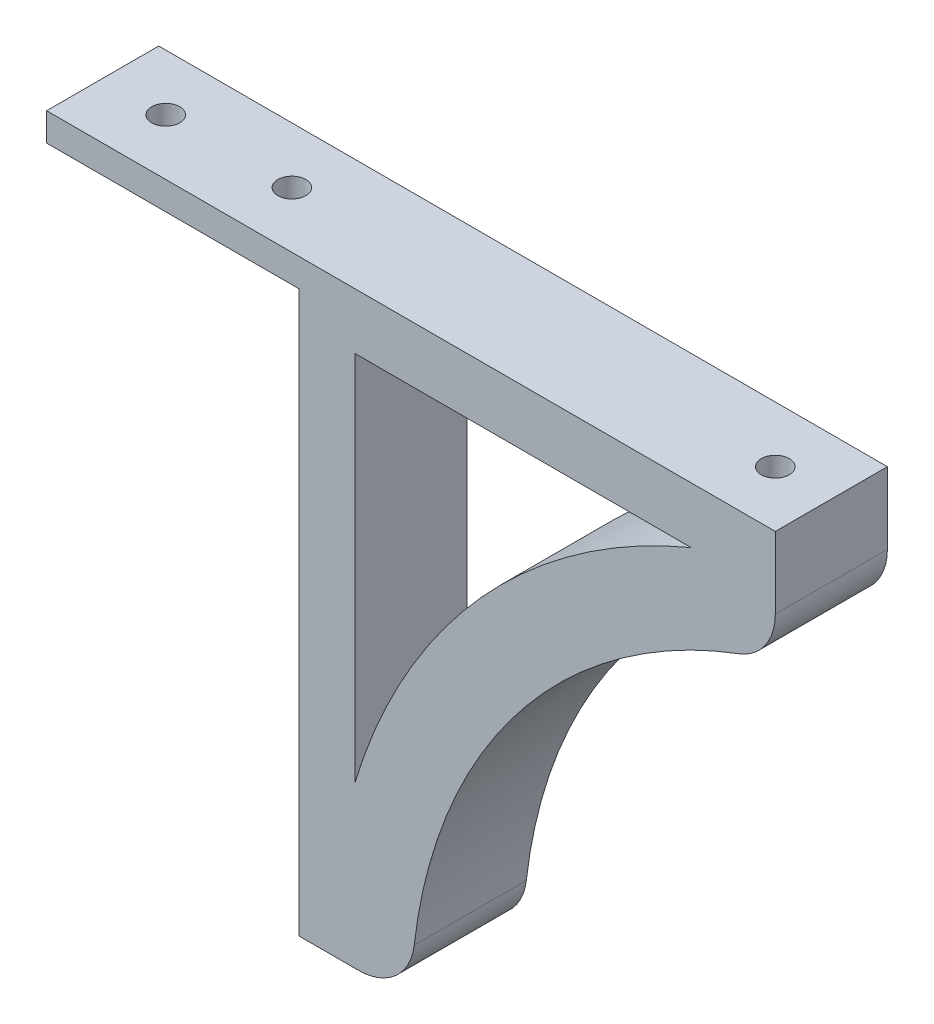
ISO-10303-21;
HEADER;
FILE_DESCRIPTION(('STEP AP214'),'2;1');
FILE_NAME('part.step','',(''),(''),'','','');
FILE_SCHEMA(('AUTOMOTIVE_DESIGN { 1 0 10303 214 1 1 1 1 }'));
ENDSEC;
DATA;
#1=APPLICATION_CONTEXT('core data for automotive mechanical design processes');
#2=APPLICATION_PROTOCOL_DEFINITION('international standard','automotive_design',2000,#1);
#3=PRODUCT_CONTEXT('',#1,'mechanical');
#4=PRODUCT('Part','Part','',(#3));
#5=PRODUCT_RELATED_PRODUCT_CATEGORY('part','',(#4));
#6=PRODUCT_DEFINITION_FORMATION('','',#4);
#7=PRODUCT_DEFINITION_CONTEXT('part definition',#1,'design');
#8=PRODUCT_DEFINITION('design','',#6,#7);
#9=PRODUCT_DEFINITION_SHAPE('','',#8);
#10=(LENGTH_UNIT() NAMED_UNIT(*) SI_UNIT(.MILLI.,.METRE.));
#11=(NAMED_UNIT(*) PLANE_ANGLE_UNIT() SI_UNIT($,.RADIAN.));
#12=(NAMED_UNIT(*) SI_UNIT($,.STERADIAN.) SOLID_ANGLE_UNIT());
#13=UNCERTAINTY_MEASURE_WITH_UNIT(LENGTH_MEASURE(1.E-05),#10,'distance_accuracy_value','');
#14=(GEOMETRIC_REPRESENTATION_CONTEXT(3) GLOBAL_UNCERTAINTY_ASSIGNED_CONTEXT((#13)) GLOBAL_UNIT_ASSIGNED_CONTEXT((#10,
#11,#12)) REPRESENTATION_CONTEXT('',''));
#15=CARTESIAN_POINT('',(0.,0.,0.));
#16=DIRECTION('',(0.,0.,1.));
#17=DIRECTION('',(1.,0.,0.));
#18=AXIS2_PLACEMENT_3D('',#15,#16,#17);
#19=CARTESIAN_POINT('',(154.988132437739,-101.461513040624,20.));
#20=DIRECTION('',(0.,0.,1.));
#21=DIRECTION('',(1.,0.,0.));
#22=AXIS2_PLACEMENT_3D('',#19,#20,#21);
#23=PLANE('',#22);
#24=DIRECTION('',(1.,0.,0.));
#25=VECTOR('',#24,1.);
#26=CARTESIAN_POINT('',(45.,-100.,20.));
#27=LINE('',#26,#25);
#28=CARTESIAN_POINT('',(45.,-100.,20.));
#29=VERTEX_POINT('',#28);
#30=CARTESIAN_POINT('',(55.6471352672879,-100.,20.));
#31=VERTEX_POINT('',#30);
#32=EDGE_CURVE('E280',#29,#31,#27,.T.);
#33=ORIENTED_EDGE('',*,*,#32,.T.);
#34=CARTESIAN_POINT('',(55.6471352672879,-90.,20.));
#35=DIRECTION('',(0.,0.,1.));
#36=DIRECTION('',(1.,0.,0.));
#37=AXIS2_PLACEMENT_3D('',#34,#35,#36);
#38=CIRCLE('',#37,10.);
#39=CARTESIAN_POINT('',(65.5812349843331,-91.1461513040624,20.));
#40=VERTEX_POINT('',#39);
#41=EDGE_CURVE('E45',#31,#40,#38,.T.);
#42=ORIENTED_EDGE('',*,*,#41,.T.);
#43=CARTESIAN_POINT('',(154.988132437739,-101.461513040624,20.));
#44=DIRECTION('',(0.,0.,-1.));
#45=DIRECTION('',(1.,0.,0.));
#46=AXIS2_PLACEMENT_3D('',#43,#44,#45);
#47=CIRCLE('',#46,90.);
#48=CARTESIAN_POINT('',(123.498813243774,-17.1500501384744,20.));
#49=VERTEX_POINT('',#48);
#50=EDGE_CURVE('E245',#40,#49,#47,.T.);
#51=ORIENTED_EDGE('',*,*,#50,.T.);
#52=CARTESIAN_POINT('',(120.,-7.78210981601328,20.));
#53=DIRECTION('',(0.,0.,1.));
#54=DIRECTION('',(1.,0.,0.));
#55=AXIS2_PLACEMENT_3D('',#52,#53,#54);
#56=CIRCLE('',#55,10.);
#57=CARTESIAN_POINT('',(130.,-7.78210981601328,20.));
#58=VERTEX_POINT('',#57);
#59=EDGE_CURVE('E147',#49,#58,#56,.T.);
#60=ORIENTED_EDGE('',*,*,#59,.T.);
#61=DIRECTION('',(0.,1.,0.));
#62=VECTOR('',#61,1.);
#63=CARTESIAN_POINT('',(130.,5.,20.));
#64=LINE('',#63,#62);
#65=CARTESIAN_POINT('',(130.,5.,20.));
#66=VERTEX_POINT('',#65);
#67=EDGE_CURVE('E239',#58,#66,#64,.T.);
#68=ORIENTED_EDGE('',*,*,#67,.T.);
#69=DIRECTION('',(-1.,0.,0.));
#70=VECTOR('',#69,1.);
#71=CARTESIAN_POINT('',(0.,5.,20.));
#72=LINE('',#71,#70);
#73=CARTESIAN_POINT('',(0.,5.,20.));
#74=VERTEX_POINT('',#73);
#75=EDGE_CURVE('E244',#66,#74,#72,.T.);
#76=ORIENTED_EDGE('',*,*,#75,.T.);
#77=DIRECTION('',(0.,-1.,0.));
#78=VECTOR('',#77,1.);
#79=CARTESIAN_POINT('',(0.,0.,20.));
#80=LINE('',#79,#78);
#81=CARTESIAN_POINT('',(0.,0.,20.));
#82=VERTEX_POINT('',#81);
#83=EDGE_CURVE('E263',#74,#82,#80,.T.);
#84=ORIENTED_EDGE('',*,*,#83,.T.);
#85=DIRECTION('',(1.,0.,0.));
#86=VECTOR('',#85,1.);
#87=CARTESIAN_POINT('',(0.,0.,20.));
#88=LINE('',#87,#86);
#89=CARTESIAN_POINT('',(45.,0.,20.));
#90=VERTEX_POINT('',#89);
#91=EDGE_CURVE('E284',#82,#90,#88,.T.);
#92=ORIENTED_EDGE('',*,*,#91,.T.);
#93=DIRECTION('',(0.,-1.,0.));
#94=VECTOR('',#93,1.);
#95=CARTESIAN_POINT('',(45.,0.,20.));
#96=LINE('',#95,#94);
#97=EDGE_CURVE('E282',#90,#29,#96,.T.);
#98=ORIENTED_EDGE('',*,*,#97,.T.);
#99=EDGE_LOOP('',(#33,#42,#51,#60,#68,#76,#84,#92,#98));
#100=FACE_BOUND('',#99,.T.);
#101=CARTESIAN_POINT('',(154.988132437739,-101.461513040624,20.));
#102=DIRECTION('',(0.,0.,-1.));
#103=DIRECTION('',(1.,0.,0.));
#104=AXIS2_PLACEMENT_3D('',#101,#102,#103);
#105=CIRCLE('',#104,104.421617656234);
#106=CARTESIAN_POINT('',(55.,-71.3575663631901,20.));
#107=VERTEX_POINT('',#106);
#108=CARTESIAN_POINT('',(115.,-5.,20.));
#109=VERTEX_POINT('',#108);
#110=EDGE_CURVE('E306',#107,#109,#105,.T.);
#111=ORIENTED_EDGE('',*,*,#110,.F.);
#112=DIRECTION('',(0.,-1.,0.));
#113=VECTOR('',#112,1.);
#114=CARTESIAN_POINT('',(55.,-5.,20.));
#115=LINE('',#114,#113);
#116=CARTESIAN_POINT('',(55.,-5.,20.));
#117=VERTEX_POINT('',#116);
#118=EDGE_CURVE('E299',#117,#107,#115,.T.);
#119=ORIENTED_EDGE('',*,*,#118,.F.);
#120=DIRECTION('',(-1.,0.,0.));
#121=VECTOR('',#120,1.);
#122=CARTESIAN_POINT('',(115.,-4.99999999999999,20.));
#123=LINE('',#122,#121);
#124=EDGE_CURVE('E295',#109,#117,#123,.T.);
#125=ORIENTED_EDGE('',*,*,#124,.F.);
#126=EDGE_LOOP('',(#111,#119,#125));
#127=FACE_BOUND('',#126,.T.);
#128=ADVANCED_FACE('F33',(#100,#127),#23,.T.);
#129=CARTESIAN_POINT('',(154.988132437739,-101.461513040624,0.));
#130=DIRECTION('',(0.,0.,1.));
#131=DIRECTION('',(1.,0.,0.));
#132=AXIS2_PLACEMENT_3D('',#129,#130,#131);
#133=PLANE('',#132);
#134=CARTESIAN_POINT('',(154.988132437739,-101.461513040624,0.));
#135=DIRECTION('',(0.,0.,-1.));
#136=DIRECTION('',(1.,0.,0.));
#137=AXIS2_PLACEMENT_3D('',#134,#135,#136);
#138=CIRCLE('',#137,90.);
#139=CARTESIAN_POINT('',(65.5812349843331,-91.1461513040624,0.));
#140=VERTEX_POINT('',#139);
#141=CARTESIAN_POINT('',(123.498813243774,-17.1500501384744,0.));
#142=VERTEX_POINT('',#141);
#143=EDGE_CURVE('E266',#140,#142,#138,.T.);
#144=ORIENTED_EDGE('',*,*,#143,.F.);
#145=CARTESIAN_POINT('',(55.6471352672879,-90.,0.));
#146=DIRECTION('',(0.,0.,1.));
#147=DIRECTION('',(1.,0.,0.));
#148=AXIS2_PLACEMENT_3D('',#145,#146,#147);
#149=CIRCLE('',#148,10.);
#150=CARTESIAN_POINT('',(55.6471352672879,-100.,0.));
#151=VERTEX_POINT('',#150);
#152=EDGE_CURVE('E159',#140,#151,#149,.F.);
#153=ORIENTED_EDGE('',*,*,#152,.T.);
#154=DIRECTION('',(1.,0.,0.));
#155=VECTOR('',#154,1.);
#156=CARTESIAN_POINT('',(45.,-100.,0.));
#157=LINE('',#156,#155);
#158=CARTESIAN_POINT('',(45.,-100.,0.));
#159=VERTEX_POINT('',#158);
#160=EDGE_CURVE('E268',#159,#151,#157,.T.);
#161=ORIENTED_EDGE('',*,*,#160,.F.);
#162=DIRECTION('',(0.,-1.,0.));
#163=VECTOR('',#162,1.);
#164=CARTESIAN_POINT('',(45.,0.,0.));
#165=LINE('',#164,#163);
#166=CARTESIAN_POINT('',(45.,0.,0.));
#167=VERTEX_POINT('',#166);
#168=EDGE_CURVE('E270',#167,#159,#165,.T.);
#169=ORIENTED_EDGE('',*,*,#168,.F.);
#170=DIRECTION('',(1.,0.,0.));
#171=VECTOR('',#170,1.);
#172=CARTESIAN_POINT('',(0.,0.,0.));
#173=LINE('',#172,#171);
#174=CARTESIAN_POINT('',(0.,0.,0.));
#175=VERTEX_POINT('',#174);
#176=EDGE_CURVE('E272',#175,#167,#173,.T.);
#177=ORIENTED_EDGE('',*,*,#176,.F.);
#178=DIRECTION('',(0.,-1.,0.));
#179=VECTOR('',#178,1.);
#180=CARTESIAN_POINT('',(0.,0.,0.));
#181=LINE('',#180,#179);
#182=CARTESIAN_POINT('',(0.,5.,0.));
#183=VERTEX_POINT('',#182);
#184=EDGE_CURVE('E274',#183,#175,#181,.T.);
#185=ORIENTED_EDGE('',*,*,#184,.F.);
#186=DIRECTION('',(-1.,0.,0.));
#187=VECTOR('',#186,1.);
#188=CARTESIAN_POINT('',(0.,5.,0.));
#189=LINE('',#188,#187);
#190=CARTESIAN_POINT('',(130.,5.,0.));
#191=VERTEX_POINT('',#190);
#192=EDGE_CURVE('E261',#191,#183,#189,.T.);
#193=ORIENTED_EDGE('',*,*,#192,.F.);
#194=DIRECTION('',(0.,1.,0.));
#195=VECTOR('',#194,1.);
#196=CARTESIAN_POINT('',(130.,5.,0.));
#197=LINE('',#196,#195);
#198=CARTESIAN_POINT('',(130.,-7.78210981601328,0.));
#199=VERTEX_POINT('',#198);
#200=EDGE_CURVE('E264',#199,#191,#197,.T.);
#201=ORIENTED_EDGE('',*,*,#200,.F.);
#202=CARTESIAN_POINT('',(120.,-7.78210981601328,0.));
#203=DIRECTION('',(0.,0.,1.));
#204=DIRECTION('',(1.,0.,0.));
#205=AXIS2_PLACEMENT_3D('',#202,#203,#204);
#206=CIRCLE('',#205,10.);
#207=EDGE_CURVE('E148',#199,#142,#206,.F.);
#208=ORIENTED_EDGE('',*,*,#207,.T.);
#209=EDGE_LOOP('',(#144,#153,#161,#169,#177,#185,#193,#201,#208));
#210=FACE_BOUND('',#209,.T.);
#211=DIRECTION('',(0.,-1.,0.));
#212=VECTOR('',#211,1.);
#213=CARTESIAN_POINT('',(55.,-5.,0.));
#214=LINE('',#213,#212);
#215=CARTESIAN_POINT('',(55.,-5.,0.));
#216=VERTEX_POINT('',#215);
#217=CARTESIAN_POINT('',(55.,-71.3575663631901,0.));
#218=VERTEX_POINT('',#217);
#219=EDGE_CURVE('E169',#216,#218,#214,.T.);
#220=ORIENTED_EDGE('',*,*,#219,.T.);
#221=CARTESIAN_POINT('',(154.988132437739,-101.461513040624,0.));
#222=DIRECTION('',(0.,0.,-1.));
#223=DIRECTION('',(1.,0.,0.));
#224=AXIS2_PLACEMENT_3D('',#221,#222,#223);
#225=CIRCLE('',#224,104.421617656234);
#226=CARTESIAN_POINT('',(115.,-4.99999999999999,0.));
#227=VERTEX_POINT('',#226);
#228=EDGE_CURVE('E300',#218,#227,#225,.T.);
#229=ORIENTED_EDGE('',*,*,#228,.T.);
#230=DIRECTION('',(-1.,0.,0.));
#231=VECTOR('',#230,1.);
#232=CARTESIAN_POINT('',(115.,-4.99999999999999,0.));
#233=LINE('',#232,#231);
#234=EDGE_CURVE('E296',#227,#216,#233,.T.);
#235=ORIENTED_EDGE('',*,*,#234,.T.);
#236=EDGE_LOOP('',(#220,#229,#235));
#237=FACE_BOUND('',#236,.T.);
#238=ADVANCED_FACE('F219',(#210,#237),#133,.F.);
#239=CARTESIAN_POINT('',(0.,0.,20.));
#240=DIRECTION('',(1.,0.,0.));
#241=DIRECTION('',(0.,0.,-1.));
#242=AXIS2_PLACEMENT_3D('',#239,#240,#241);
#243=PLANE('',#242);
#244=ORIENTED_EDGE('',*,*,#184,.T.);
#245=DIRECTION('',(0.,0.,-1.));
#246=VECTOR('',#245,1.);
#247=CARTESIAN_POINT('',(0.,0.,20.));
#248=LINE('',#247,#246);
#249=EDGE_CURVE('E247',#82,#175,#248,.T.);
#250=ORIENTED_EDGE('',*,*,#249,.F.);
#251=ORIENTED_EDGE('',*,*,#83,.F.);
#252=DIRECTION('',(0.,0.,-1.));
#253=VECTOR('',#252,1.);
#254=CARTESIAN_POINT('',(0.,5.,20.));
#255=LINE('',#254,#253);
#256=EDGE_CURVE('E258',#74,#183,#255,.T.);
#257=ORIENTED_EDGE('',*,*,#256,.T.);
#258=EDGE_LOOP('',(#244,#250,#251,#257));
#259=FACE_BOUND('',#258,.T.);
#260=ADVANCED_FACE('F223',(#259),#243,.F.);
#261=CARTESIAN_POINT('',(0.,0.,20.));
#262=DIRECTION('',(0.,1.,0.));
#263=DIRECTION('',(0.,0.,1.));
#264=AXIS2_PLACEMENT_3D('',#261,#262,#263);
#265=PLANE('',#264);
#266=CARTESIAN_POINT('',(33.75,0.,10.));
#267=DIRECTION('',(0.,-1.,0.));
#268=DIRECTION('',(0.,0.,-1.));
#269=AXIS2_PLACEMENT_3D('',#266,#267,#268);
#270=CIRCLE('',#269,2.5);
#271=CARTESIAN_POINT('',(33.75,0.,7.5));
#272=VERTEX_POINT('',#271);
#273=EDGE_CURVE('E167',#272,#272,#270,.T.);
#274=ORIENTED_EDGE('',*,*,#273,.F.);
#275=EDGE_LOOP('',(#274));
#276=FACE_BOUND('',#275,.T.);
#277=CARTESIAN_POINT('',(11.25,0.,10.));
#278=DIRECTION('',(0.,-1.,0.));
#279=DIRECTION('',(0.,0.,-1.));
#280=AXIS2_PLACEMENT_3D('',#277,#278,#279);
#281=CIRCLE('',#280,2.5);
#282=CARTESIAN_POINT('',(11.25,0.,7.5));
#283=VERTEX_POINT('',#282);
#284=EDGE_CURVE('E310',#283,#283,#281,.T.);
#285=ORIENTED_EDGE('',*,*,#284,.F.);
#286=EDGE_LOOP('',(#285));
#287=FACE_BOUND('',#286,.T.);
#288=ORIENTED_EDGE('',*,*,#176,.T.);
#289=DIRECTION('',(0.,0.,-1.));
#290=VECTOR('',#289,1.);
#291=CARTESIAN_POINT('',(45.,0.,20.));
#292=LINE('',#291,#290);
#293=EDGE_CURVE('E249',#90,#167,#292,.T.);
#294=ORIENTED_EDGE('',*,*,#293,.F.);
#295=ORIENTED_EDGE('',*,*,#91,.F.);
#296=ORIENTED_EDGE('',*,*,#249,.T.);
#297=EDGE_LOOP('',(#288,#294,#295,#296));
#298=FACE_BOUND('',#297,.T.);
#299=ADVANCED_FACE('F316',(#276,#287,#298),#265,.F.);
#300=CARTESIAN_POINT('',(45.,0.,20.));
#301=DIRECTION('',(1.,0.,0.));
#302=DIRECTION('',(0.,1.,0.));
#303=AXIS2_PLACEMENT_3D('',#300,#301,#302);
#304=PLANE('',#303);
#305=ORIENTED_EDGE('',*,*,#168,.T.);
#306=DIRECTION('',(0.,0.,-1.));
#307=VECTOR('',#306,1.);
#308=CARTESIAN_POINT('',(45.,-100.,20.));
#309=LINE('',#308,#307);
#310=EDGE_CURVE('E254',#29,#159,#309,.T.);
#311=ORIENTED_EDGE('',*,*,#310,.F.);
#312=ORIENTED_EDGE('',*,*,#97,.F.);
#313=ORIENTED_EDGE('',*,*,#293,.T.);
#314=EDGE_LOOP('',(#305,#311,#312,#313));
#315=FACE_BOUND('',#314,.T.);
#316=ADVANCED_FACE('F319',(#315),#304,.F.);
#317=CARTESIAN_POINT('',(45.,-100.,20.));
#318=DIRECTION('',(0.,1.,0.));
#319=DIRECTION('',(0.,0.,1.));
#320=AXIS2_PLACEMENT_3D('',#317,#318,#319);
#321=PLANE('',#320);
#322=ORIENTED_EDGE('',*,*,#160,.T.);
#323=DIRECTION('',(0.,0.,-1.));
#324=VECTOR('',#323,1.);
#325=CARTESIAN_POINT('',(55.6471352672879,-100.,20.));
#326=LINE('',#325,#324);
#327=EDGE_CURVE('E58',#151,#31,#326,.F.);
#328=ORIENTED_EDGE('',*,*,#327,.T.);
#329=ORIENTED_EDGE('',*,*,#32,.F.);
#330=ORIENTED_EDGE('',*,*,#310,.T.);
#331=EDGE_LOOP('',(#322,#328,#329,#330));
#332=FACE_BOUND('',#331,.T.);
#333=ADVANCED_FACE('F235',(#332),#321,.F.);
#334=CARTESIAN_POINT('',(154.988132437739,-101.461513040624,20.));
#335=DIRECTION('',(0.,0.,-1.));
#336=DIRECTION('',(-1.,0.,0.));
#337=AXIS2_PLACEMENT_3D('',#334,#335,#336);
#338=CYLINDRICAL_SURFACE('',#337,90.);
#339=DIRECTION('',(0.,0.,-1.));
#340=VECTOR('',#339,1.);
#341=CARTESIAN_POINT('',(123.498813243774,-17.1500501384743,20.));
#342=LINE('',#341,#340);
#343=CARTESIAN_POINT('',(123.498813243774,-17.1500501384743,7.6765745363382));
#344=VERTEX_POINT('',#343);
#345=EDGE_CURVE('E140',#142,#344,#342,.F.);
#346=ORIENTED_EDGE('',*,*,#345,.T.);
#347=CARTESIAN_POINT('',(123.498813243774,-17.1500501384744,7.6765745363382));
#348=CARTESIAN_POINT('',(123.432029480468,-17.1749929137483,7.57598107328478));
#349=CARTESIAN_POINT('',(123.361086284067,-17.2015798777439,7.47858466828241));
#350=CARTESIAN_POINT('',(123.211632277553,-17.2578290190987,7.29079675104584));
#351=CARTESIAN_POINT('',(123.133124502419,-17.2874899635068,7.20040245554315));
#352=CARTESIAN_POINT('',(122.969502282682,-17.3495938728802,7.02742754975479));
#353=CARTESIAN_POINT('',(122.884409956415,-17.3820275593026,6.94482268527202));
#354=CARTESIAN_POINT('',(122.708174785798,-17.4495301706207,6.78756246504156));
#355=CARTESIAN_POINT('',(122.61703146001,-17.4845993052314,6.71290774306922));
#356=CARTESIAN_POINT('',(122.335883209816,-17.5933381366108,6.50165174135745));
#357=CARTESIAN_POINT('',(122.137811338415,-17.6706710616375,6.37739312698994));
#358=CARTESIAN_POINT('',(121.726464241216,-17.8331062109641,6.16423074763659));
#359=CARTESIAN_POINT('',(121.513178522861,-17.9182138088124,6.07535166640846));
#360=CARTESIAN_POINT('',(121.065607520255,-18.0989106676756,5.93027502970891));
#361=CARTESIAN_POINT('',(120.830808142839,-18.1948161693681,5.87605296358993));
#362=CARTESIAN_POINT('',(120.357096304149,-18.3907172362973,5.80836629574343));
#363=CARTESIAN_POINT('',(120.118182796821,-18.4907138508989,5.7949122182239));
#364=CARTESIAN_POINT('',(119.628537158135,-18.6981539257428,5.80889632571102));
#365=CARTESIAN_POINT('',(119.377911716787,-18.8056959077381,5.83872037816834));
#366=CARTESIAN_POINT('',(118.885504099873,-19.0195794925256,5.94274718551067));
#367=CARTESIAN_POINT('',(118.643723887491,-19.125920825258,6.01695972969417));
#368=CARTESIAN_POINT('',(118.171372804544,-19.3360354370926,6.2102411028097));
#369=CARTESIAN_POINT('',(117.941079002179,-19.4397290113924,6.33008685327625));
#370=CARTESIAN_POINT('',(117.613423527335,-19.5887720769018,6.54149914679061));
#371=CARTESIAN_POINT('',(117.507112543047,-19.6373966260543,6.61729721155735));
#372=CARTESIAN_POINT('',(117.301316188332,-19.7319795128387,6.77909863679293));
#373=CARTESIAN_POINT('',(117.201827423394,-19.777939174646,6.86509686299409));
#374=CARTESIAN_POINT('',(117.014717289001,-19.8647610270001,7.04296782530411));
#375=CARTESIAN_POINT('',(116.926770779193,-19.905757011978,7.13443370491604));
#376=CARTESIAN_POINT('',(116.75891591152,-19.9843040583875,7.32576057278811));
#377=CARTESIAN_POINT('',(116.679003618897,-20.0218568053435,7.42561740715419));
#378=CARTESIAN_POINT('',(116.528072307615,-20.0930256582807,7.63310922111636));
#379=CARTESIAN_POINT('',(116.457050586553,-20.126642960288,7.74074182140445));
#380=CARTESIAN_POINT('',(116.324736917907,-20.1894562592297,7.96304957444275));
#381=CARTESIAN_POINT('',(116.263443911456,-20.2186527373076,8.07772395888329));
#382=CARTESIAN_POINT('',(116.156638984076,-20.2696520865572,8.30219254340013));
#383=CARTESIAN_POINT('',(116.110187609886,-20.2918909098504,8.41144144576507));
#384=CARTESIAN_POINT('',(116.026501808049,-20.3320270635738,8.63418100711781));
#385=CARTESIAN_POINT('',(115.989266316272,-20.3499248952399,8.74767117463658));
#386=CARTESIAN_POINT('',(115.924500143333,-20.3810966309261,8.97794382366866));
#387=CARTESIAN_POINT('',(115.896964311429,-20.3943729890106,9.09472452214313));
#388=CARTESIAN_POINT('',(115.85194194134,-20.4160984799662,9.33064791081445));
#389=CARTESIAN_POINT('',(115.834454680135,-20.4245479601431,9.44979043043401));
#390=CARTESIAN_POINT('',(115.8108780453,-20.4359436763921,9.67863015966464));
#391=CARTESIAN_POINT('',(115.803907273365,-20.4393154291013,9.788216398052));
#392=CARTESIAN_POINT('',(115.79857261257,-20.4418955968456,10.0076857476057));
#393=CARTESIAN_POINT('',(115.800211486412,-20.4411026755012,10.1175689427546));
#394=CARTESIAN_POINT('',(115.812080720214,-20.4353628502933,10.3366974730051));
#395=CARTESIAN_POINT('',(115.822306231602,-20.4304182907141,10.4459431330531));
#396=CARTESIAN_POINT('',(115.851226178037,-20.4164464083429,10.6630823262749));
#397=CARTESIAN_POINT('',(115.869923758766,-20.4074175690582,10.7709753419058));
#398=CARTESIAN_POINT('',(115.914913112737,-20.3857204986459,10.9814815337305));
#399=CARTESIAN_POINT('',(115.940968189962,-20.3731657579959,11.0841570031125));
#400=CARTESIAN_POINT('',(116.00058675925,-20.3444841894113,11.2868055389406));
#401=CARTESIAN_POINT('',(116.034152888213,-20.3283561070056,11.3867776424688));
#402=CARTESIAN_POINT('',(116.145629897362,-20.2748957136985,11.681631350362));
#403=CARTESIAN_POINT('',(116.234359437369,-20.2324678380276,11.8716350674884));
#404=CARTESIAN_POINT('',(116.441782305987,-20.1338266652681,12.2419020576102));
#405=CARTESIAN_POINT('',(116.561609139261,-20.077094903922,12.4213844719316));
#406=CARTESIAN_POINT('',(116.825098687872,-19.9532065051035,12.7578400498238));
#407=CARTESIAN_POINT('',(116.96876958965,-19.8860462877157,12.9148054479458));
#408=CARTESIAN_POINT('',(117.289306647987,-19.7373897295383,13.2163159975323));
#409=CARTESIAN_POINT('',(117.467976569522,-19.6551534428695,13.3585767599613));
#410=CARTESIAN_POINT('',(117.843616351249,-19.4839089486398,13.6112753976019));
#411=CARTESIAN_POINT('',(118.040593287678,-19.3948981249354,13.7217008992691));
#412=CARTESIAN_POINT('',(118.466233488935,-19.2045385367497,13.9175486965803));
#413=CARTESIAN_POINT('',(118.696155923572,-19.102797430537,13.9998623995086));
#414=CARTESIAN_POINT('',(119.165932196917,-18.8973815038391,14.1235194608392));
#415=CARTESIAN_POINT('',(119.405789472795,-18.7937060210487,14.1648485142846));
#416=CARTESIAN_POINT('',(119.9019930104,-18.5818472584358,14.2065896890001));
#417=CARTESIAN_POINT('',(120.15855452737,-18.4737051168485,14.2047973515533));
#418=CARTESIAN_POINT('',(120.540943580053,-18.3145919981967,14.1669973263534));
#419=CARTESIAN_POINT('',(120.66807637144,-18.2620391182149,14.1485228646632));
#420=CARTESIAN_POINT('',(120.920634201849,-18.1583070548002,14.0998708417893));
#421=CARTESIAN_POINT('',(121.046059940374,-18.1071272998044,14.0696982333753));
#422=CARTESIAN_POINT('',(121.293507153373,-18.006794972483,13.9979176654748));
#423=CARTESIAN_POINT('',(121.415544203448,-17.9576323272488,13.956377349998));
#424=CARTESIAN_POINT('',(121.655929337989,-17.8613875286643,13.8619377044677));
#425=CARTESIAN_POINT('',(121.774279029764,-17.8143044649844,13.8090434052103));
#426=CARTESIAN_POINT('',(122.006255268308,-17.7225655168013,13.6921271997998));
#427=CARTESIAN_POINT('',(122.119884092632,-17.6779084586109,13.6281107385635));
#428=CARTESIAN_POINT('',(122.341374954171,-17.591355328811,13.4892741551986));
#429=CARTESIAN_POINT('',(122.449240013063,-17.5494578077693,13.4144597715983));
#430=CARTESIAN_POINT('',(122.644460641127,-17.4740355942022,13.2649497405595));
#431=CARTESIAN_POINT('',(122.732649330068,-17.4401339222574,13.1915288194933));
#432=CARTESIAN_POINT('',(122.903204957438,-17.3748567609972,13.0372067223702));
#433=CARTESIAN_POINT('',(122.985573007433,-17.3434807891887,12.9563069813921));
#434=CARTESIAN_POINT('',(123.144004925748,-17.2833760946018,12.7872349919674));
#435=CARTESIAN_POINT('',(123.220052786883,-17.2546540741142,12.6990453422753));
#436=CARTESIAN_POINT('',(123.364985740157,-17.2001185524667,12.516054621271));
#437=CARTESIAN_POINT('',(123.433867399036,-17.1743064449282,12.4212504169934));
#438=CARTESIAN_POINT('',(123.498813243774,-17.1500501384744,12.3234254636618));
#439=B_SPLINE_CURVE_WITH_KNOTS('',3,(#347,#348,#349,#350,#351,#352,#353,#354,#355,#356,#357,
#358,#359,#360,#361,#362,#363,#364,#365,#366,#367,#368,#369,#370,#371,#372,#373,#374,#375,#376,
#377,#378,#379,#380,#381,#382,#383,#384,#385,#386,#387,#388,#389,#390,#391,#392,#393,#394,#395,
#396,#397,#398,#399,#400,#401,#402,#403,#404,#405,#406,#407,#408,#409,#410,#411,#412,#413,#414,
#415,#416,#417,#418,#419,#420,#421,#422,#423,#424,#425,#426,#427,#428,#429,#430,#431,#432,#433,
#434,#435,#436,#437,#438),.UNSPECIFIED.,.F.,.F.,(4,2,2,2,2,2,2,2,2,2,2,2,2,2,2,2,2,2,2,2,2,2,2,
2,2,2,2,2,2,2,2,2,2,2,2,2,2,2,2,2,2,2,2,2,2,4),(0.,0.369724027550688,0.739300331227354,
1.10768499566969,1.47609900532398,2.2113801461372,2.94717338596244,3.72185365795576,
4.49673389571436,5.31598860620232,6.13542405920209,6.96948415649987,7.38700058138145,
7.80430773351258,8.20382065485391,8.60313695180328,9.00233157523127,9.40148272075658,
9.76333534469962,10.1251461671386,10.4867645690445,10.8483569483363,11.1775271026565,
11.5068028890516,11.8358928699207,12.1651051422894,12.4847422018334,12.8044916526983,
13.4434272943306,14.110098587893,14.7769992466431,15.5021843202547,16.2276508757608,
17.0178240296584,17.8082728823587,18.6392132023905,19.0552033773877,19.4710176221644,
19.8844094203885,20.29761842703,20.7106257119688,21.1234143079672,21.4819923549665,
21.8405017382114,22.1998930780001,22.5594558134835),.UNSPECIFIED.);
#440=CARTESIAN_POINT('',(123.498813243774,-17.1500501384744,12.3234254636618));
#441=VERTEX_POINT('',#440);
#442=EDGE_CURVE('E50',#344,#441,#439,.T.);
#443=ORIENTED_EDGE('',*,*,#442,.T.);
#444=EDGE_CURVE('E138',#441,#49,#342,.F.);
#445=ORIENTED_EDGE('',*,*,#444,.T.);
#446=ORIENTED_EDGE('',*,*,#50,.F.);
#447=DIRECTION('',(0.,0.,-1.));
#448=VECTOR('',#447,1.);
#449=CARTESIAN_POINT('',(65.5812349843331,-91.1461513040624,20.));
#450=LINE('',#449,#448);
#451=EDGE_CURVE('E156',#40,#140,#450,.T.);
#452=ORIENTED_EDGE('',*,*,#451,.T.);
#453=ORIENTED_EDGE('',*,*,#143,.T.);
#454=EDGE_LOOP('',(#346,#443,#445,#446,#452,#453));
#455=FACE_BOUND('',#454,.T.);
#456=ADVANCED_FACE('F136',(#455),#338,.F.);
#457=CARTESIAN_POINT('',(130.,5.,20.));
#458=DIRECTION('',(-1.,0.,0.));
#459=DIRECTION('',(0.,0.,1.));
#460=AXIS2_PLACEMENT_3D('',#457,#458,#459);
#461=PLANE('',#460);
#462=ORIENTED_EDGE('',*,*,#67,.F.);
#463=DIRECTION('',(0.,0.,-1.));
#464=VECTOR('',#463,1.);
#465=CARTESIAN_POINT('',(130.,-7.78210981601328,20.));
#466=LINE('',#465,#464);
#467=EDGE_CURVE('E151',#58,#199,#466,.T.);
#468=ORIENTED_EDGE('',*,*,#467,.T.);
#469=ORIENTED_EDGE('',*,*,#200,.T.);
#470=DIRECTION('',(0.,0.,-1.));
#471=VECTOR('',#470,1.);
#472=CARTESIAN_POINT('',(130.,5.,20.));
#473=LINE('',#472,#471);
#474=EDGE_CURVE('E242',#66,#191,#473,.T.);
#475=ORIENTED_EDGE('',*,*,#474,.F.);
#476=EDGE_LOOP('',(#462,#468,#469,#475));
#477=FACE_BOUND('',#476,.T.);
#478=ADVANCED_FACE('F226',(#477),#461,.F.);
#479=CARTESIAN_POINT('',(0.,5.,20.));
#480=DIRECTION('',(0.,-1.,0.));
#481=DIRECTION('',(0.,0.,-1.));
#482=AXIS2_PLACEMENT_3D('',#479,#480,#481);
#483=PLANE('',#482);
#484=CARTESIAN_POINT('',(120.,5.,10.));
#485=DIRECTION('',(0.,1.,0.));
#486=DIRECTION('',(0.,0.,1.));
#487=AXIS2_PLACEMENT_3D('',#484,#485,#486);
#488=CIRCLE('',#487,2.5);
#489=CARTESIAN_POINT('',(120.,5.,12.5));
#490=VERTEX_POINT('',#489);
#491=EDGE_CURVE('E141',#490,#490,#488,.T.);
#492=ORIENTED_EDGE('',*,*,#491,.F.);
#493=EDGE_LOOP('',(#492));
#494=FACE_BOUND('',#493,.T.);
#495=CARTESIAN_POINT('',(33.75,5.,10.));
#496=DIRECTION('',(0.,-1.,0.));
#497=DIRECTION('',(0.,0.,-1.));
#498=AXIS2_PLACEMENT_3D('',#495,#496,#497);
#499=CIRCLE('',#498,2.5);
#500=CARTESIAN_POINT('',(33.75,5.,7.5));
#501=VERTEX_POINT('',#500);
#502=EDGE_CURVE('E166',#501,#501,#499,.T.);
#503=ORIENTED_EDGE('',*,*,#502,.T.);
#504=EDGE_LOOP('',(#503));
#505=FACE_BOUND('',#504,.T.);
#506=CARTESIAN_POINT('',(11.25,5.,10.));
#507=DIRECTION('',(0.,-1.,0.));
#508=DIRECTION('',(0.,0.,-1.));
#509=AXIS2_PLACEMENT_3D('',#506,#507,#508);
#510=CIRCLE('',#509,2.5);
#511=CARTESIAN_POINT('',(11.25,5.,7.5));
#512=VERTEX_POINT('',#511);
#513=EDGE_CURVE('E163',#512,#512,#510,.T.);
#514=ORIENTED_EDGE('',*,*,#513,.T.);
#515=EDGE_LOOP('',(#514));
#516=FACE_BOUND('',#515,.T.);
#517=ORIENTED_EDGE('',*,*,#192,.T.);
#518=ORIENTED_EDGE('',*,*,#256,.F.);
#519=ORIENTED_EDGE('',*,*,#75,.F.);
#520=ORIENTED_EDGE('',*,*,#474,.T.);
#521=EDGE_LOOP('',(#517,#518,#519,#520));
#522=FACE_BOUND('',#521,.T.);
#523=ADVANCED_FACE('F215',(#494,#505,#516,#522),#483,.F.);
#524=CARTESIAN_POINT('',(55.,-5.,20.));
#525=DIRECTION('',(1.,0.,0.));
#526=DIRECTION('',(0.,1.,0.));
#527=AXIS2_PLACEMENT_3D('',#524,#525,#526);
#528=PLANE('',#527);
#529=ORIENTED_EDGE('',*,*,#219,.F.);
#530=DIRECTION('',(0.,0.,-1.));
#531=VECTOR('',#530,1.);
#532=CARTESIAN_POINT('',(55.,-5.,20.));
#533=LINE('',#532,#531);
#534=EDGE_CURVE('E292',#117,#216,#533,.T.);
#535=ORIENTED_EDGE('',*,*,#534,.F.);
#536=ORIENTED_EDGE('',*,*,#118,.T.);
#537=DIRECTION('',(0.,0.,-1.));
#538=VECTOR('',#537,1.);
#539=CARTESIAN_POINT('',(55.,-71.3575663631901,20.));
#540=LINE('',#539,#538);
#541=EDGE_CURVE('E277',#107,#218,#540,.T.);
#542=ORIENTED_EDGE('',*,*,#541,.T.);
#543=EDGE_LOOP('',(#529,#535,#536,#542));
#544=FACE_BOUND('',#543,.T.);
#545=ADVANCED_FACE('F211',(#544),#528,.T.);
#546=CARTESIAN_POINT('',(154.988132437739,-101.461513040624,20.));
#547=DIRECTION('',(0.,0.,-1.));
#548=DIRECTION('',(-1.,0.,0.));
#549=AXIS2_PLACEMENT_3D('',#546,#547,#548);
#550=CYLINDRICAL_SURFACE('',#549,104.421617656234);
#551=ORIENTED_EDGE('',*,*,#228,.F.);
#552=ORIENTED_EDGE('',*,*,#541,.F.);
#553=ORIENTED_EDGE('',*,*,#110,.T.);
#554=DIRECTION('',(0.,0.,-1.));
#555=VECTOR('',#554,1.);
#556=CARTESIAN_POINT('',(115.,-4.99999999999999,20.));
#557=LINE('',#556,#555);
#558=EDGE_CURVE('E290',#109,#227,#557,.T.);
#559=ORIENTED_EDGE('',*,*,#558,.T.);
#560=EDGE_LOOP('',(#551,#552,#553,#559));
#561=FACE_BOUND('',#560,.T.);
#562=ADVANCED_FACE('F207',(#561),#550,.T.);
#563=CARTESIAN_POINT('',(115.,-4.99999999999999,20.));
#564=DIRECTION('',(0.,-1.,0.));
#565=DIRECTION('',(1.,0.,0.));
#566=AXIS2_PLACEMENT_3D('',#563,#564,#565);
#567=PLANE('',#566);
#568=ORIENTED_EDGE('',*,*,#234,.F.);
#569=ORIENTED_EDGE('',*,*,#558,.F.);
#570=ORIENTED_EDGE('',*,*,#124,.T.);
#571=ORIENTED_EDGE('',*,*,#534,.T.);
#572=EDGE_LOOP('',(#568,#569,#570,#571));
#573=FACE_BOUND('',#572,.T.);
#574=ADVANCED_FACE('F204',(#573),#567,.T.);
#575=CARTESIAN_POINT('',(120.,-7.78210981601328,20.));
#576=DIRECTION('',(0.,0.,-1.));
#577=DIRECTION('',(-1.,0.,0.));
#578=AXIS2_PLACEMENT_3D('',#575,#576,#577);
#579=CYLINDRICAL_SURFACE('',#578,10.);
#580=CARTESIAN_POINT('',(123.498813243774,-17.1500501384744,7.6765745363382));
#581=CARTESIAN_POINT('',(123.560466366439,-17.127020506432,7.76940588313669));
#582=CARTESIAN_POINT('',(123.618498529693,-17.104655082857,7.86482439479204));
#583=CARTESIAN_POINT('',(123.726960345413,-17.0618287647838,8.06034629515494));
#584=CARTESIAN_POINT('',(123.777386945545,-17.0413686361892,8.16045154377734));
#585=CARTESIAN_POINT('',(123.870337652234,-17.0029026321405,8.365025675011));
#586=CARTESIAN_POINT('',(123.912842647968,-16.9849027191094,8.46950438427019));
#587=CARTESIAN_POINT('',(123.989426795902,-16.9519633646106,8.68196307471142));
#588=CARTESIAN_POINT('',(124.023507096637,-16.9370235060145,8.7899425763587));
#589=CARTESIAN_POINT('',(124.082999027707,-16.9106465245088,9.00902163262845));
#590=CARTESIAN_POINT('',(124.10838582674,-16.8992194445254,9.12012915956894));
#591=CARTESIAN_POINT('',(124.150086540711,-16.8803133651795,9.34441190025291));
#592=CARTESIAN_POINT('',(124.166397148103,-16.8728358051514,9.45758785227424));
#593=CARTESIAN_POINT('',(124.189712771593,-16.8621137793896,9.68484169871362));
#594=CARTESIAN_POINT('',(124.196738305715,-16.8588599803325,9.79891704216528));
#595=CARTESIAN_POINT('',(124.201464752482,-16.8566732515819,10.027343514574));
#596=CARTESIAN_POINT('',(124.199162486009,-16.8577417950368,10.1416947242796));
#597=CARTESIAN_POINT('',(124.185617600158,-16.8639959314574,10.3637733339224));
#598=CARTESIAN_POINT('',(124.1748460273,-16.8689645840467,10.4715360105745));
#599=CARTESIAN_POINT('',(124.14505521862,-16.882592490853,10.6857207718011));
#600=CARTESIAN_POINT('',(124.126032700796,-16.8912532136525,10.7921423055525));
#601=CARTESIAN_POINT('',(124.079916573155,-16.9120013849786,11.002961178417));
#602=CARTESIAN_POINT('',(124.052817064692,-16.9240913375672,11.1073569785798));
#603=CARTESIAN_POINT('',(123.990808683558,-16.9513293698297,11.3134042293026));
#604=CARTESIAN_POINT('',(123.955898166208,-16.9664780934898,11.4150550968331));
#605=CARTESIAN_POINT('',(123.862027632232,-17.0064452473136,11.6577479557547));
#606=CARTESIAN_POINT('',(123.799164458424,-17.0326301488708,11.7970696484954));
#607=CARTESIAN_POINT('',(123.659321240226,-17.0888250450484,12.0669943837036));
#608=CARTESIAN_POINT('',(123.582391063671,-17.1188214167896,12.1976260690917));
#609=CARTESIAN_POINT('',(123.498813243774,-17.1500501384744,12.3234254636618));
#610=B_SPLINE_CURVE_WITH_KNOTS('',3,(#580,#581,#582,#583,#584,#585,#586,#587,#588,#589,#590,
#591,#592,#593,#594,#595,#596,#597,#598,#599,#600,#601,#602,#603,#604,#605,#606,#607,#608,#609),
.UNSPECIFIED.,.F.,.F.,(4,2,2,2,2,2,2,2,2,2,2,2,2,2,4),(0.,0.341316314816082,0.682769247327175,
1.02503556125212,1.36725518836095,1.71044430176708,2.05375839839253,2.39631256876722,
2.73898349888742,3.06383842095041,3.38882268022297,3.71404486027993,4.03933558335812,
4.5035693877778,4.96618830202201),.UNSPECIFIED.);
#611=EDGE_CURVE('E11',#344,#441,#610,.T.);
#612=ORIENTED_EDGE('',*,*,#611,.F.);
#613=ORIENTED_EDGE('',*,*,#345,.F.);
#614=ORIENTED_EDGE('',*,*,#207,.F.);
#615=ORIENTED_EDGE('',*,*,#467,.F.);
#616=ORIENTED_EDGE('',*,*,#59,.F.);
#617=ORIENTED_EDGE('',*,*,#444,.F.);
#618=EDGE_LOOP('',(#612,#613,#614,#615,#616,#617));
#619=FACE_BOUND('',#618,.T.);
#620=ADVANCED_FACE('F145',(#619),#579,.T.);
#621=CARTESIAN_POINT('',(55.6471352672879,-90.,20.));
#622=DIRECTION('',(0.,0.,-1.));
#623=DIRECTION('',(-1.,0.,0.));
#624=AXIS2_PLACEMENT_3D('',#621,#622,#623);
#625=CYLINDRICAL_SURFACE('',#624,10.);
#626=ORIENTED_EDGE('',*,*,#41,.F.);
#627=ORIENTED_EDGE('',*,*,#327,.F.);
#628=ORIENTED_EDGE('',*,*,#152,.F.);
#629=ORIENTED_EDGE('',*,*,#451,.F.);
#630=EDGE_LOOP('',(#626,#627,#628,#629));
#631=FACE_BOUND('',#630,.T.);
#632=ADVANCED_FACE('F35',(#631),#625,.T.);
#633=CARTESIAN_POINT('',(11.25,20.,10.));
#634=DIRECTION('',(0.,-1.,0.));
#635=DIRECTION('',(0.,0.,-1.));
#636=AXIS2_PLACEMENT_3D('',#633,#634,#635);
#637=CYLINDRICAL_SURFACE('',#636,2.5);
#638=ORIENTED_EDGE('',*,*,#284,.T.);
#639=EDGE_LOOP('',(#638));
#640=FACE_BOUND('',#639,.T.);
#641=ORIENTED_EDGE('',*,*,#513,.F.);
#642=EDGE_LOOP('',(#641));
#643=FACE_BOUND('',#642,.T.);
#644=ADVANCED_FACE('F199',(#640,#643),#637,.F.);
#645=CARTESIAN_POINT('',(33.75,20.,10.));
#646=DIRECTION('',(0.,-1.,0.));
#647=DIRECTION('',(0.,0.,-1.));
#648=AXIS2_PLACEMENT_3D('',#645,#646,#647);
#649=CYLINDRICAL_SURFACE('',#648,2.5);
#650=ORIENTED_EDGE('',*,*,#273,.T.);
#651=EDGE_LOOP('',(#650));
#652=FACE_BOUND('',#651,.T.);
#653=ORIENTED_EDGE('',*,*,#502,.F.);
#654=EDGE_LOOP('',(#653));
#655=FACE_BOUND('',#654,.T.);
#656=ADVANCED_FACE('F196',(#652,#655),#649,.F.);
#657=CARTESIAN_POINT('',(120.,-100.,10.));
#658=DIRECTION('',(0.,1.,0.));
#659=DIRECTION('',(0.,0.,1.));
#660=AXIS2_PLACEMENT_3D('',#657,#658,#659);
#661=CYLINDRICAL_SURFACE('',#660,2.5);
#662=CARTESIAN_POINT('',(120.,-14.1900469679111,10.));
#663=DIRECTION('',(0.,1.,0.));
#664=DIRECTION('',(0.,0.,1.));
#665=AXIS2_PLACEMENT_3D('',#662,#663,#664);
#666=CIRCLE('',#665,2.5);
#667=CARTESIAN_POINT('',(120.,-14.1900469679111,12.5));
#668=VERTEX_POINT('',#667);
#669=EDGE_CURVE('E142',#668,#668,#666,.F.);
#670=ORIENTED_EDGE('',*,*,#669,.T.);
#671=EDGE_LOOP('',(#670));
#672=FACE_BOUND('',#671,.T.);
#673=ORIENTED_EDGE('',*,*,#491,.T.);
#674=EDGE_LOOP('',(#673));
#675=FACE_BOUND('',#674,.T.);
#676=ADVANCED_FACE('F192',(#672,#675),#661,.F.);
#677=CARTESIAN_POINT('',(120.,-30.1900469679111,10.));
#678=DIRECTION('',(0.,1.,0.));
#679=DIRECTION('',(0.,0.,1.));
#680=AXIS2_PLACEMENT_3D('',#677,#678,#679);
#681=CYLINDRICAL_SURFACE('',#680,4.19999999999999);
#682=CARTESIAN_POINT('',(120.,-14.1900469679111,10.));
#683=DIRECTION('',(0.,1.,0.));
#684=DIRECTION('',(0.,0.,1.));
#685=AXIS2_PLACEMENT_3D('',#682,#683,#684);
#686=CIRCLE('',#685,4.19999999999999);
#687=CARTESIAN_POINT('',(120.,-14.1900469679111,14.2));
#688=VERTEX_POINT('',#687);
#689=EDGE_CURVE('E171',#688,#688,#686,.T.);
#690=ORIENTED_EDGE('',*,*,#689,.T.);
#691=EDGE_LOOP('',(#690));
#692=FACE_BOUND('',#691,.T.);
#693=ORIENTED_EDGE('',*,*,#611,.T.);
#694=ORIENTED_EDGE('',*,*,#442,.F.);
#695=EDGE_LOOP('',(#693,#694));
#696=FACE_BOUND('',#695,.T.);
#697=ADVANCED_FACE('F130',(#692,#696),#681,.F.);
#698=CARTESIAN_POINT('',(120.,-14.1900469679111,10.));
#699=DIRECTION('',(0.,1.,0.));
#700=DIRECTION('',(0.,0.,1.));
#701=AXIS2_PLACEMENT_3D('',#698,#699,#700);
#702=PLANE('',#701);
#703=ORIENTED_EDGE('',*,*,#689,.F.);
#704=EDGE_LOOP('',(#703));
#705=FACE_BOUND('',#704,.T.);
#706=ORIENTED_EDGE('',*,*,#669,.F.);
#707=EDGE_LOOP('',(#706));
#708=FACE_BOUND('',#707,.T.);
#709=ADVANCED_FACE('F191',(#705,#708),#702,.F.);
#710=CLOSED_SHELL('',(#128,#238,#260,#299,#316,#333,#456,#478,#523,#545,#562,#574,#620,#632,
#644,#656,#676,#697,#709));
#711=MANIFOLD_SOLID_BREP('B2',#710);
#712=ADVANCED_BREP_SHAPE_REPRESENTATION('',(#18,#711),#14);
#713=SHAPE_DEFINITION_REPRESENTATION(#9,#712);
ENDSEC;
END-ISO-10303-21;
